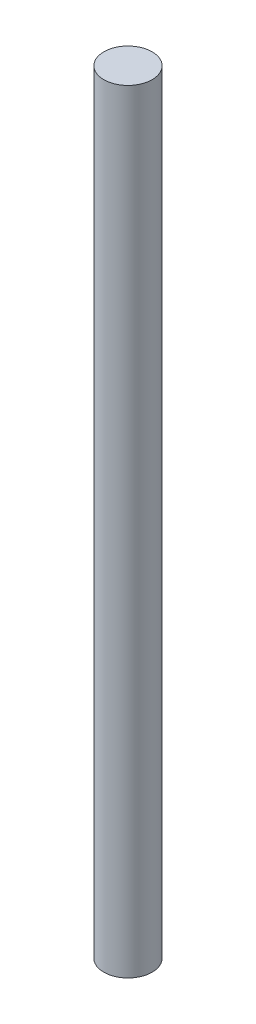
ISO-10303-21;
HEADER;
FILE_DESCRIPTION(('STEP AP214'),'2;1');
FILE_NAME('part.step','',(''),(''),'','','');
FILE_SCHEMA(('AUTOMOTIVE_DESIGN { 1 0 10303 214 1 1 1 1 }'));
ENDSEC;
DATA;
#1=APPLICATION_CONTEXT('core data for automotive mechanical design processes');
#2=APPLICATION_PROTOCOL_DEFINITION('international standard','automotive_design',2000,#1);
#3=PRODUCT_CONTEXT('',#1,'mechanical');
#4=PRODUCT('Part','Part','',(#3));
#5=PRODUCT_RELATED_PRODUCT_CATEGORY('part','',(#4));
#6=PRODUCT_DEFINITION_FORMATION('','',#4);
#7=PRODUCT_DEFINITION_CONTEXT('part definition',#1,'design');
#8=PRODUCT_DEFINITION('design','',#6,#7);
#9=PRODUCT_DEFINITION_SHAPE('','',#8);
#10=(LENGTH_UNIT() NAMED_UNIT(*) SI_UNIT(.MILLI.,.METRE.));
#11=(NAMED_UNIT(*) PLANE_ANGLE_UNIT() SI_UNIT($,.RADIAN.));
#12=(NAMED_UNIT(*) SI_UNIT($,.STERADIAN.) SOLID_ANGLE_UNIT());
#13=UNCERTAINTY_MEASURE_WITH_UNIT(LENGTH_MEASURE(1.E-05),#10,'distance_accuracy_value','');
#14=(GEOMETRIC_REPRESENTATION_CONTEXT(3) GLOBAL_UNCERTAINTY_ASSIGNED_CONTEXT((#13)) GLOBAL_UNIT_ASSIGNED_CONTEXT((#10,
#11,#12)) REPRESENTATION_CONTEXT('',''));
#15=CARTESIAN_POINT('',(0.,0.,0.));
#16=DIRECTION('',(0.,0.,1.));
#17=DIRECTION('',(1.,0.,0.));
#18=AXIS2_PLACEMENT_3D('',#15,#16,#17);
#19=CARTESIAN_POINT('',(0.,101.6,0.));
#20=DIRECTION('',(0.,-1.,0.));
#21=DIRECTION('',(0.,0.,-1.));
#22=AXIS2_PLACEMENT_3D('',#19,#20,#21);
#23=CYLINDRICAL_SURFACE('',#22,3.175);
#24=CARTESIAN_POINT('',(0.,101.6,0.));
#25=DIRECTION('',(0.,1.,0.));
#26=DIRECTION('',(0.,0.,1.));
#27=AXIS2_PLACEMENT_3D('',#24,#25,#26);
#28=CIRCLE('',#27,3.175);
#29=CARTESIAN_POINT('',(0.,101.6,3.175));
#30=VERTEX_POINT('',#29);
#31=EDGE_CURVE('E10',#30,#30,#28,.T.);
#32=ORIENTED_EDGE('',*,*,#31,.F.);
#33=EDGE_LOOP('',(#32));
#34=FACE_BOUND('',#33,.T.);
#35=CARTESIAN_POINT('',(0.,0.,0.));
#36=DIRECTION('',(0.,1.,0.));
#37=DIRECTION('',(0.,0.,1.));
#38=AXIS2_PLACEMENT_3D('',#35,#36,#37);
#39=CIRCLE('',#38,3.175);
#40=CARTESIAN_POINT('',(0.,0.,3.175));
#41=VERTEX_POINT('',#40);
#42=EDGE_CURVE('E31',#41,#41,#39,.T.);
#43=ORIENTED_EDGE('',*,*,#42,.T.);
#44=EDGE_LOOP('',(#43));
#45=FACE_BOUND('',#44,.T.);
#46=ADVANCED_FACE('F28',(#34,#45),#23,.T.);
#47=CARTESIAN_POINT('',(0.,101.6,0.));
#48=DIRECTION('',(0.,1.,0.));
#49=DIRECTION('',(0.,0.,1.));
#50=AXIS2_PLACEMENT_3D('',#47,#48,#49);
#51=PLANE('',#50);
#52=ORIENTED_EDGE('',*,*,#31,.T.);
#53=EDGE_LOOP('',(#52));
#54=FACE_BOUND('',#53,.T.);
#55=ADVANCED_FACE('F43',(#54),#51,.T.);
#56=CARTESIAN_POINT('',(0.,0.,0.));
#57=DIRECTION('',(0.,1.,0.));
#58=DIRECTION('',(0.,0.,1.));
#59=AXIS2_PLACEMENT_3D('',#56,#57,#58);
#60=PLANE('',#59);
#61=ORIENTED_EDGE('',*,*,#42,.F.);
#62=EDGE_LOOP('',(#61));
#63=FACE_BOUND('',#62,.T.);
#64=ADVANCED_FACE('F41',(#63),#60,.F.);
#65=CLOSED_SHELL('',(#46,#55,#64));
#66=MANIFOLD_SOLID_BREP('B2',#65);
#67=ADVANCED_BREP_SHAPE_REPRESENTATION('',(#18,#66),#14);
#68=SHAPE_DEFINITION_REPRESENTATION(#9,#67);
ENDSEC;
END-ISO-10303-21;
